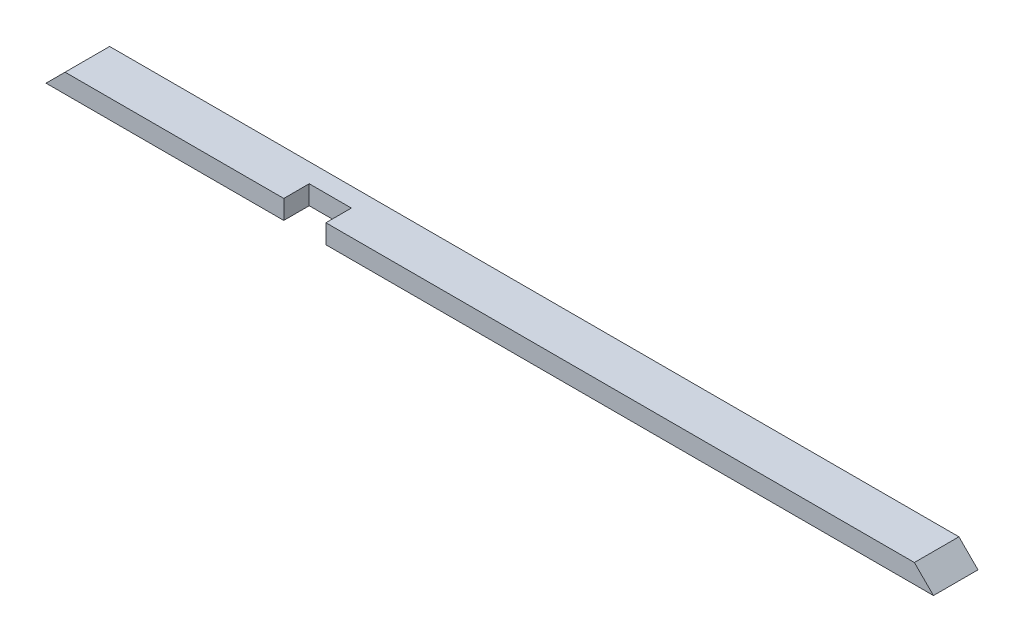
ISO-10303-21;
HEADER;
FILE_DESCRIPTION(('STEP AP214'),'2;1');
FILE_NAME('part.step','',(''),(''),'','','');
FILE_SCHEMA(('AUTOMOTIVE_DESIGN { 1 0 10303 214 1 1 1 1 }'));
ENDSEC;
DATA;
#1=APPLICATION_CONTEXT('core data for automotive mechanical design processes');
#2=APPLICATION_PROTOCOL_DEFINITION('international standard','automotive_design',2000,#1);
#3=PRODUCT_CONTEXT('',#1,'mechanical');
#4=PRODUCT('Part','Part','',(#3));
#5=PRODUCT_RELATED_PRODUCT_CATEGORY('part','',(#4));
#6=PRODUCT_DEFINITION_FORMATION('','',#4);
#7=PRODUCT_DEFINITION_CONTEXT('part definition',#1,'design');
#8=PRODUCT_DEFINITION('design','',#6,#7);
#9=PRODUCT_DEFINITION_SHAPE('','',#8);
#10=(LENGTH_UNIT() NAMED_UNIT(*) SI_UNIT(.MILLI.,.METRE.));
#11=(NAMED_UNIT(*) PLANE_ANGLE_UNIT() SI_UNIT($,.RADIAN.));
#12=(NAMED_UNIT(*) SI_UNIT($,.STERADIAN.) SOLID_ANGLE_UNIT());
#13=UNCERTAINTY_MEASURE_WITH_UNIT(LENGTH_MEASURE(1.E-05),#10,'distance_accuracy_value','');
#14=(GEOMETRIC_REPRESENTATION_CONTEXT(3) GLOBAL_UNCERTAINTY_ASSIGNED_CONTEXT((#13)) GLOBAL_UNIT_ASSIGNED_CONTEXT((#10,
#11,#12)) REPRESENTATION_CONTEXT('',''));
#15=CARTESIAN_POINT('',(0.,0.,0.));
#16=DIRECTION('',(0.,0.,1.));
#17=DIRECTION('',(1.,0.,0.));
#18=AXIS2_PLACEMENT_3D('',#15,#16,#17);
#19=CARTESIAN_POINT('',(0.,38.1,0.));
#20=DIRECTION('',(0.,0.,-1.));
#21=DIRECTION('',(-1.,0.,0.));
#22=AXIS2_PLACEMENT_3D('',#19,#20,#21);
#23=PLANE('',#22);
#24=DIRECTION('',(1.,0.,0.));
#25=VECTOR('',#24,1.);
#26=CARTESIAN_POINT('',(0.,38.1,0.));
#27=LINE('',#26,#25);
#28=CARTESIAN_POINT('',(558.8,38.1000000000001,0.));
#29=VERTEX_POINT('',#28);
#30=CARTESIAN_POINT('',(1733.55,38.1000000000001,0.));
#31=VERTEX_POINT('',#30);
#32=EDGE_CURVE('E122',#29,#31,#27,.T.);
#33=ORIENTED_EDGE('',*,*,#32,.F.);
#34=DIRECTION('',(0.,-1.,0.));
#35=VECTOR('',#34,1.);
#36=CARTESIAN_POINT('',(558.8,38.1000000000001,0.));
#37=LINE('',#36,#35);
#38=CARTESIAN_POINT('',(558.8,0.,0.));
#39=VERTEX_POINT('',#38);
#40=EDGE_CURVE('E107',#29,#39,#37,.T.);
#41=ORIENTED_EDGE('',*,*,#40,.T.);
#42=DIRECTION('',(1.,0.,0.));
#43=VECTOR('',#42,1.);
#44=CARTESIAN_POINT('',(0.,0.,0.));
#45=LINE('',#44,#43);
#46=CARTESIAN_POINT('',(1771.65,0.,0.));
#47=VERTEX_POINT('',#46);
#48=EDGE_CURVE('E141',#39,#47,#45,.T.);
#49=ORIENTED_EDGE('',*,*,#48,.T.);
#50=DIRECTION('',(0.707106781186547,-0.707106781186548,0.));
#51=VECTOR('',#50,1.);
#52=CARTESIAN_POINT('',(1733.55,38.1000000000001,0.));
#53=LINE('',#52,#51);
#54=EDGE_CURVE('E131',#31,#47,#53,.T.);
#55=ORIENTED_EDGE('',*,*,#54,.F.);
#56=EDGE_LOOP('',(#33,#41,#49,#55));
#57=FACE_BOUND('',#56,.T.);
#58=ADVANCED_FACE('F39',(#57),#23,.F.);
#59=CARTESIAN_POINT('',(0.,0.,0.));
#60=VERTEX_POINT('',#59);
#61=CARTESIAN_POINT('',(474.6625,0.,0.));
#62=VERTEX_POINT('',#61);
#63=EDGE_CURVE('E143',#60,#62,#45,.T.);
#64=ORIENTED_EDGE('',*,*,#63,.T.);
#65=DIRECTION('',(0.,-1.,0.));
#66=VECTOR('',#65,1.);
#67=CARTESIAN_POINT('',(474.6625,38.1000000000001,0.));
#68=LINE('',#67,#66);
#69=CARTESIAN_POINT('',(474.6625,38.1000000000001,0.));
#70=VERTEX_POINT('',#69);
#71=EDGE_CURVE('E56',#70,#62,#68,.T.);
#72=ORIENTED_EDGE('',*,*,#71,.F.);
#73=CARTESIAN_POINT('',(38.1,38.1,0.));
#74=VERTEX_POINT('',#73);
#75=EDGE_CURVE('E48',#74,#70,#27,.T.);
#76=ORIENTED_EDGE('',*,*,#75,.F.);
#77=DIRECTION('',(0.707106781186547,0.707106781186547,0.));
#78=VECTOR('',#77,1.);
#79=CARTESIAN_POINT('',(0.,0.,0.));
#80=LINE('',#79,#78);
#81=EDGE_CURVE('E160',#60,#74,#80,.T.);
#82=ORIENTED_EDGE('',*,*,#81,.F.);
#83=EDGE_LOOP('',(#64,#72,#76,#82));
#84=FACE_BOUND('',#83,.T.);
#85=ADVANCED_FACE('F41',(#84),#23,.F.);
#86=CARTESIAN_POINT('',(0.,38.1,-88.9));
#87=DIRECTION('',(0.,0.,1.));
#88=DIRECTION('',(1.,0.,0.));
#89=AXIS2_PLACEMENT_3D('',#86,#87,#88);
#90=PLANE('',#89);
#91=DIRECTION('',(-1.,0.,0.));
#92=VECTOR('',#91,1.);
#93=CARTESIAN_POINT('',(0.,0.,-88.9));
#94=LINE('',#93,#92);
#95=CARTESIAN_POINT('',(1771.65,0.,-88.9));
#96=VERTEX_POINT('',#95);
#97=CARTESIAN_POINT('',(0.,0.,-88.9));
#98=VERTEX_POINT('',#97);
#99=EDGE_CURVE('E43',#96,#98,#94,.T.);
#100=ORIENTED_EDGE('',*,*,#99,.T.);
#101=DIRECTION('',(0.707106781186547,0.707106781186547,0.));
#102=VECTOR('',#101,1.);
#103=CARTESIAN_POINT('',(0.,0.,-88.9));
#104=LINE('',#103,#102);
#105=CARTESIAN_POINT('',(38.1,38.1,-88.9));
#106=VERTEX_POINT('',#105);
#107=EDGE_CURVE('E64',#98,#106,#104,.T.);
#108=ORIENTED_EDGE('',*,*,#107,.T.);
#109=DIRECTION('',(-1.,0.,0.));
#110=VECTOR('',#109,1.);
#111=CARTESIAN_POINT('',(0.,38.1,-88.9));
#112=LINE('',#111,#110);
#113=CARTESIAN_POINT('',(1733.55,38.1000000000001,-88.9));
#114=VERTEX_POINT('',#113);
#115=EDGE_CURVE('E11',#114,#106,#112,.T.);
#116=ORIENTED_EDGE('',*,*,#115,.F.);
#117=DIRECTION('',(0.707106781186547,-0.707106781186548,0.));
#118=VECTOR('',#117,1.);
#119=CARTESIAN_POINT('',(1733.55,38.1000000000001,-88.9));
#120=LINE('',#119,#118);
#121=EDGE_CURVE('E136',#114,#96,#120,.T.);
#122=ORIENTED_EDGE('',*,*,#121,.T.);
#123=EDGE_LOOP('',(#100,#108,#116,#122));
#124=FACE_BOUND('',#123,.T.);
#125=ADVANCED_FACE('F153',(#124),#90,.F.);
#126=CARTESIAN_POINT('',(0.,38.1,0.));
#127=DIRECTION('',(0.,-1.,0.));
#128=DIRECTION('',(0.,0.,-1.));
#129=AXIS2_PLACEMENT_3D('',#126,#127,#128);
#130=PLANE('',#129);
#131=DIRECTION('',(1.,0.,0.));
#132=VECTOR('',#131,1.);
#133=CARTESIAN_POINT('',(558.8,38.1000000000001,-50.8));
#134=LINE('',#133,#132);
#135=CARTESIAN_POINT('',(474.6625,38.1000000000001,-50.8));
#136=VERTEX_POINT('',#135);
#137=CARTESIAN_POINT('',(558.8,38.1000000000001,-50.8));
#138=VERTEX_POINT('',#137);
#139=EDGE_CURVE('E117',#136,#138,#134,.T.);
#140=ORIENTED_EDGE('',*,*,#139,.T.);
#141=DIRECTION('',(0.,0.,1.));
#142=VECTOR('',#141,1.);
#143=CARTESIAN_POINT('',(558.8,38.1000000000001,0.));
#144=LINE('',#143,#142);
#145=EDGE_CURVE('E110',#138,#29,#144,.T.);
#146=ORIENTED_EDGE('',*,*,#145,.T.);
#147=ORIENTED_EDGE('',*,*,#32,.T.);
#148=DIRECTION('',(0.,0.,1.));
#149=VECTOR('',#148,1.);
#150=CARTESIAN_POINT('',(1733.55,38.1000000000001,-88.9));
#151=LINE('',#150,#149);
#152=EDGE_CURVE('E155',#114,#31,#151,.T.);
#153=ORIENTED_EDGE('',*,*,#152,.F.);
#154=ORIENTED_EDGE('',*,*,#115,.T.);
#155=DIRECTION('',(0.,0.,1.));
#156=VECTOR('',#155,1.);
#157=CARTESIAN_POINT('',(38.1,38.1,-88.9));
#158=LINE('',#157,#156);
#159=EDGE_CURVE('E142',#106,#74,#158,.T.);
#160=ORIENTED_EDGE('',*,*,#159,.T.);
#161=ORIENTED_EDGE('',*,*,#75,.T.);
#162=DIRECTION('',(0.,0.,-1.));
#163=VECTOR('',#162,1.);
#164=CARTESIAN_POINT('',(474.6625,38.1000000000001,0.));
#165=LINE('',#164,#163);
#166=EDGE_CURVE('E126',#70,#136,#165,.T.);
#167=ORIENTED_EDGE('',*,*,#166,.T.);
#168=EDGE_LOOP('',(#140,#146,#147,#153,#154,#160,#161,#167));
#169=FACE_BOUND('',#168,.T.);
#170=ADVANCED_FACE('F120',(#169),#130,.F.);
#171=CARTESIAN_POINT('',(0.,0.,0.));
#172=DIRECTION('',(0.,-1.,0.));
#173=DIRECTION('',(0.,0.,-1.));
#174=AXIS2_PLACEMENT_3D('',#171,#172,#173);
#175=PLANE('',#174);
#176=DIRECTION('',(0.,0.,1.));
#177=VECTOR('',#176,1.);
#178=CARTESIAN_POINT('',(558.8,0.,0.));
#179=LINE('',#178,#177);
#180=CARTESIAN_POINT('',(558.8,0.,-50.8));
#181=VERTEX_POINT('',#180);
#182=EDGE_CURVE('E113',#181,#39,#179,.T.);
#183=ORIENTED_EDGE('',*,*,#182,.F.);
#184=DIRECTION('',(1.,0.,0.));
#185=VECTOR('',#184,1.);
#186=CARTESIAN_POINT('',(558.8,0.,-50.8));
#187=LINE('',#186,#185);
#188=CARTESIAN_POINT('',(474.6625,0.,-50.8));
#189=VERTEX_POINT('',#188);
#190=EDGE_CURVE('E127',#189,#181,#187,.T.);
#191=ORIENTED_EDGE('',*,*,#190,.F.);
#192=DIRECTION('',(0.,0.,-1.));
#193=VECTOR('',#192,1.);
#194=CARTESIAN_POINT('',(474.6625,0.,0.));
#195=LINE('',#194,#193);
#196=EDGE_CURVE('E176',#62,#189,#195,.T.);
#197=ORIENTED_EDGE('',*,*,#196,.F.);
#198=ORIENTED_EDGE('',*,*,#63,.F.);
#199=DIRECTION('',(0.,0.,1.));
#200=VECTOR('',#199,1.);
#201=CARTESIAN_POINT('',(0.,0.,0.));
#202=LINE('',#201,#200);
#203=EDGE_CURVE('E139',#98,#60,#202,.T.);
#204=ORIENTED_EDGE('',*,*,#203,.F.);
#205=ORIENTED_EDGE('',*,*,#99,.F.);
#206=DIRECTION('',(0.,0.,-1.));
#207=VECTOR('',#206,1.);
#208=CARTESIAN_POINT('',(1771.65,0.,0.));
#209=LINE('',#208,#207);
#210=EDGE_CURVE('E134',#47,#96,#209,.T.);
#211=ORIENTED_EDGE('',*,*,#210,.F.);
#212=ORIENTED_EDGE('',*,*,#48,.F.);
#213=EDGE_LOOP('',(#183,#191,#197,#198,#204,#205,#211,#212));
#214=FACE_BOUND('',#213,.T.);
#215=ADVANCED_FACE('F156',(#214),#175,.T.);
#216=CARTESIAN_POINT('',(1733.55,38.1000000000001,-88.9));
#217=DIRECTION('',(-0.707106781186548,-0.707106781186547,0.));
#218=DIRECTION('',(0.707106781186547,-0.707106781186548,0.));
#219=AXIS2_PLACEMENT_3D('',#216,#217,#218);
#220=PLANE('',#219);
#221=ORIENTED_EDGE('',*,*,#54,.T.);
#222=ORIENTED_EDGE('',*,*,#210,.T.);
#223=ORIENTED_EDGE('',*,*,#121,.F.);
#224=ORIENTED_EDGE('',*,*,#152,.T.);
#225=EDGE_LOOP('',(#221,#222,#223,#224));
#226=FACE_BOUND('',#225,.T.);
#227=ADVANCED_FACE('F148',(#226),#220,.F.);
#228=CARTESIAN_POINT('',(0.,0.,-88.9));
#229=DIRECTION('',(0.707106781186547,-0.707106781186547,0.));
#230=DIRECTION('',(0.707106781186548,0.707106781186548,0.));
#231=AXIS2_PLACEMENT_3D('',#228,#229,#230);
#232=PLANE('',#231);
#233=ORIENTED_EDGE('',*,*,#81,.T.);
#234=ORIENTED_EDGE('',*,*,#159,.F.);
#235=ORIENTED_EDGE('',*,*,#107,.F.);
#236=ORIENTED_EDGE('',*,*,#203,.T.);
#237=EDGE_LOOP('',(#233,#234,#235,#236));
#238=FACE_BOUND('',#237,.T.);
#239=ADVANCED_FACE('F159',(#238),#232,.F.);
#240=CARTESIAN_POINT('',(558.8,38.1000000000001,0.));
#241=DIRECTION('',(1.,0.,0.));
#242=DIRECTION('',(0.,0.,-1.));
#243=AXIS2_PLACEMENT_3D('',#240,#241,#242);
#244=PLANE('',#243);
#245=ORIENTED_EDGE('',*,*,#182,.T.);
#246=ORIENTED_EDGE('',*,*,#40,.F.);
#247=ORIENTED_EDGE('',*,*,#145,.F.);
#248=DIRECTION('',(0.,-1.,0.));
#249=VECTOR('',#248,1.);
#250=CARTESIAN_POINT('',(558.8,38.1000000000001,-50.8));
#251=LINE('',#250,#249);
#252=EDGE_CURVE('E168',#138,#181,#251,.T.);
#253=ORIENTED_EDGE('',*,*,#252,.T.);
#254=EDGE_LOOP('',(#245,#246,#247,#253));
#255=FACE_BOUND('',#254,.T.);
#256=ADVANCED_FACE('F109',(#255),#244,.F.);
#257=CARTESIAN_POINT('',(558.8,38.1000000000001,-50.8));
#258=DIRECTION('',(0.,0.,-1.));
#259=DIRECTION('',(-1.,0.,0.));
#260=AXIS2_PLACEMENT_3D('',#257,#258,#259);
#261=PLANE('',#260);
#262=ORIENTED_EDGE('',*,*,#190,.T.);
#263=ORIENTED_EDGE('',*,*,#252,.F.);
#264=ORIENTED_EDGE('',*,*,#139,.F.);
#265=DIRECTION('',(0.,-1.,0.));
#266=VECTOR('',#265,1.);
#267=CARTESIAN_POINT('',(474.6625,38.1000000000001,-50.8));
#268=LINE('',#267,#266);
#269=EDGE_CURVE('E169',#136,#189,#268,.T.);
#270=ORIENTED_EDGE('',*,*,#269,.T.);
#271=EDGE_LOOP('',(#262,#263,#264,#270));
#272=FACE_BOUND('',#271,.T.);
#273=ADVANCED_FACE('F183',(#272),#261,.F.);
#274=CARTESIAN_POINT('',(474.6625,38.1000000000001,0.));
#275=DIRECTION('',(-1.,0.,0.));
#276=DIRECTION('',(0.,0.,1.));
#277=AXIS2_PLACEMENT_3D('',#274,#275,#276);
#278=PLANE('',#277);
#279=ORIENTED_EDGE('',*,*,#196,.T.);
#280=ORIENTED_EDGE('',*,*,#269,.F.);
#281=ORIENTED_EDGE('',*,*,#166,.F.);
#282=ORIENTED_EDGE('',*,*,#71,.T.);
#283=EDGE_LOOP('',(#279,#280,#281,#282));
#284=FACE_BOUND('',#283,.T.);
#285=ADVANCED_FACE('F180',(#284),#278,.F.);
#286=CLOSED_SHELL('',(#58,#85,#125,#170,#215,#227,#239,#256,#273,#285));
#287=MANIFOLD_SOLID_BREP('B2',#286);
#288=ADVANCED_BREP_SHAPE_REPRESENTATION('',(#18,#287),#14);
#289=SHAPE_DEFINITION_REPRESENTATION(#9,#288);
ENDSEC;
END-ISO-10303-21;
